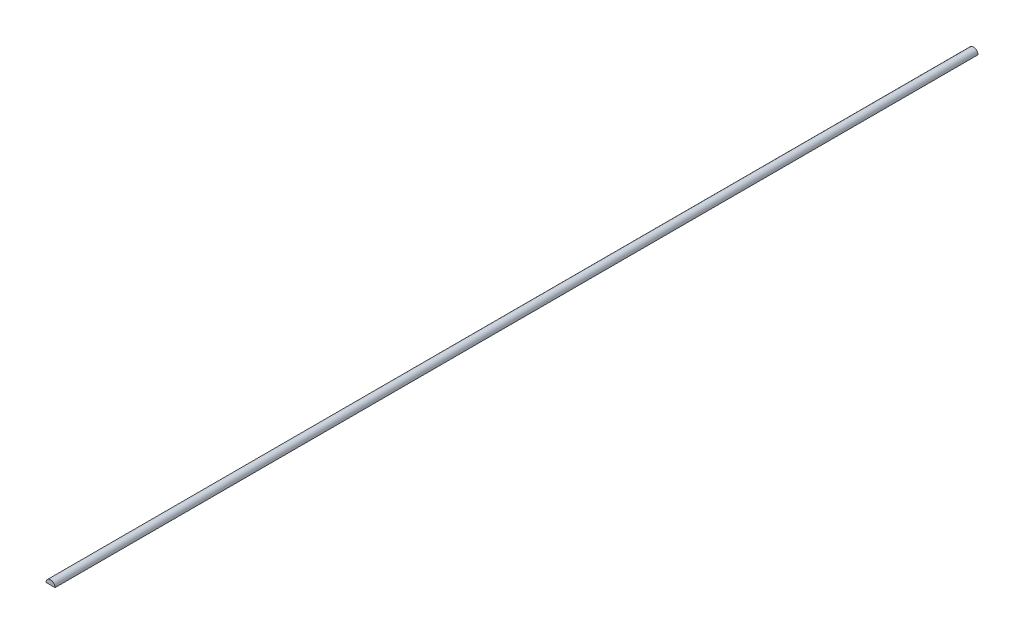
ISO-10303-21;
HEADER;
FILE_DESCRIPTION(('STEP AP214'),'2;1');
FILE_NAME('part.step','',(''),(''),'','','');
FILE_SCHEMA(('AUTOMOTIVE_DESIGN { 1 0 10303 214 1 1 1 1 }'));
ENDSEC;
DATA;
#1=APPLICATION_CONTEXT('core data for automotive mechanical design processes');
#2=APPLICATION_PROTOCOL_DEFINITION('international standard','automotive_design',2000,#1);
#3=PRODUCT_CONTEXT('',#1,'mechanical');
#4=PRODUCT('Part','Part','',(#3));
#5=PRODUCT_RELATED_PRODUCT_CATEGORY('part','',(#4));
#6=PRODUCT_DEFINITION_FORMATION('','',#4);
#7=PRODUCT_DEFINITION_CONTEXT('part definition',#1,'design');
#8=PRODUCT_DEFINITION('design','',#6,#7);
#9=PRODUCT_DEFINITION_SHAPE('','',#8);
#10=(LENGTH_UNIT() NAMED_UNIT(*) SI_UNIT(.MILLI.,.METRE.));
#11=(NAMED_UNIT(*) PLANE_ANGLE_UNIT() SI_UNIT($,.RADIAN.));
#12=(NAMED_UNIT(*) SI_UNIT($,.STERADIAN.) SOLID_ANGLE_UNIT());
#13=UNCERTAINTY_MEASURE_WITH_UNIT(LENGTH_MEASURE(1.E-05),#10,'distance_accuracy_value','');
#14=(GEOMETRIC_REPRESENTATION_CONTEXT(3) GLOBAL_UNCERTAINTY_ASSIGNED_CONTEXT((#13)) GLOBAL_UNIT_ASSIGNED_CONTEXT((#10,
#11,#12)) REPRESENTATION_CONTEXT('',''));
#15=CARTESIAN_POINT('',(0.,0.,0.));
#16=DIRECTION('',(0.,0.,1.));
#17=DIRECTION('',(1.,0.,0.));
#18=AXIS2_PLACEMENT_3D('',#15,#16,#17);
#19=CARTESIAN_POINT('',(0.,0.,101.95));
#20=DIRECTION('',(0.,0.,-1.));
#21=DIRECTION('',(-1.,0.,0.));
#22=AXIS2_PLACEMENT_3D('',#19,#20,#21);
#23=CYLINDRICAL_SURFACE('',#22,1.);
#24=CARTESIAN_POINT('',(0.,0.,-101.95));
#25=DIRECTION('',(0.,0.,1.));
#26=DIRECTION('',(1.,0.,0.));
#27=AXIS2_PLACEMENT_3D('',#24,#25,#26);
#28=CIRCLE('',#27,1.);
#29=CARTESIAN_POINT('',(1.,0.,-101.95));
#30=VERTEX_POINT('',#29);
#31=CARTESIAN_POINT('',(-1.,0.,-101.95));
#32=VERTEX_POINT('',#31);
#33=EDGE_CURVE('E63',#30,#32,#28,.T.);
#34=ORIENTED_EDGE('',*,*,#33,.T.);
#35=DIRECTION('',(0.,0.,-1.));
#36=VECTOR('',#35,1.);
#37=CARTESIAN_POINT('',(-1.,0.,101.95));
#38=LINE('',#37,#36);
#39=CARTESIAN_POINT('',(-1.,0.,101.95));
#40=VERTEX_POINT('',#39);
#41=EDGE_CURVE('E11',#40,#32,#38,.T.);
#42=ORIENTED_EDGE('',*,*,#41,.F.);
#43=CARTESIAN_POINT('',(0.,0.,101.95));
#44=DIRECTION('',(0.,0.,1.));
#45=DIRECTION('',(1.,0.,0.));
#46=AXIS2_PLACEMENT_3D('',#43,#44,#45);
#47=CIRCLE('',#46,1.);
#48=CARTESIAN_POINT('',(1.,0.,101.95));
#49=VERTEX_POINT('',#48);
#50=EDGE_CURVE('E62',#49,#40,#47,.T.);
#51=ORIENTED_EDGE('',*,*,#50,.F.);
#52=DIRECTION('',(0.,0.,-1.));
#53=VECTOR('',#52,1.);
#54=CARTESIAN_POINT('',(1.,0.,101.95));
#55=LINE('',#54,#53);
#56=EDGE_CURVE('E40',#49,#30,#55,.T.);
#57=ORIENTED_EDGE('',*,*,#56,.T.);
#58=EDGE_LOOP('',(#34,#42,#51,#57));
#59=FACE_BOUND('',#58,.T.);
#60=ADVANCED_FACE('F32',(#59),#23,.T.);
#61=CARTESIAN_POINT('',(-1.,0.,101.95));
#62=DIRECTION('',(0.,1.,0.));
#63=DIRECTION('',(0.,0.,1.));
#64=AXIS2_PLACEMENT_3D('',#61,#62,#63);
#65=PLANE('',#64);
#66=DIRECTION('',(1.,0.,0.));
#67=VECTOR('',#66,1.);
#68=CARTESIAN_POINT('',(-1.,0.,-101.95));
#69=LINE('',#68,#67);
#70=EDGE_CURVE('E55',#32,#30,#69,.T.);
#71=ORIENTED_EDGE('',*,*,#70,.T.);
#72=ORIENTED_EDGE('',*,*,#56,.F.);
#73=DIRECTION('',(1.,0.,0.));
#74=VECTOR('',#73,1.);
#75=CARTESIAN_POINT('',(-1.,0.,101.95));
#76=LINE('',#75,#74);
#77=EDGE_CURVE('E47',#40,#49,#76,.T.);
#78=ORIENTED_EDGE('',*,*,#77,.F.);
#79=ORIENTED_EDGE('',*,*,#41,.T.);
#80=EDGE_LOOP('',(#71,#72,#78,#79));
#81=FACE_BOUND('',#80,.T.);
#82=ADVANCED_FACE('F58',(#81),#65,.F.);
#83=CARTESIAN_POINT('',(0.,0.,101.95));
#84=DIRECTION('',(0.,0.,1.));
#85=DIRECTION('',(1.,0.,0.));
#86=AXIS2_PLACEMENT_3D('',#83,#84,#85);
#87=PLANE('',#86);
#88=ORIENTED_EDGE('',*,*,#50,.T.);
#89=ORIENTED_EDGE('',*,*,#77,.T.);
#90=EDGE_LOOP('',(#88,#89));
#91=FACE_BOUND('',#90,.T.);
#92=ADVANCED_FACE('F70',(#91),#87,.T.);
#93=CARTESIAN_POINT('',(0.,0.,-101.95));
#94=DIRECTION('',(0.,0.,1.));
#95=DIRECTION('',(1.,0.,0.));
#96=AXIS2_PLACEMENT_3D('',#93,#94,#95);
#97=PLANE('',#96);
#98=ORIENTED_EDGE('',*,*,#33,.F.);
#99=ORIENTED_EDGE('',*,*,#70,.F.);
#100=EDGE_LOOP('',(#98,#99));
#101=FACE_BOUND('',#100,.T.);
#102=ADVANCED_FACE('F66',(#101),#97,.F.);
#103=CLOSED_SHELL('',(#60,#82,#92,#102));
#104=MANIFOLD_SOLID_BREP('B2',#103);
#105=ADVANCED_BREP_SHAPE_REPRESENTATION('',(#18,#104),#14);
#106=SHAPE_DEFINITION_REPRESENTATION(#9,#105);
ENDSEC;
END-ISO-10303-21;
